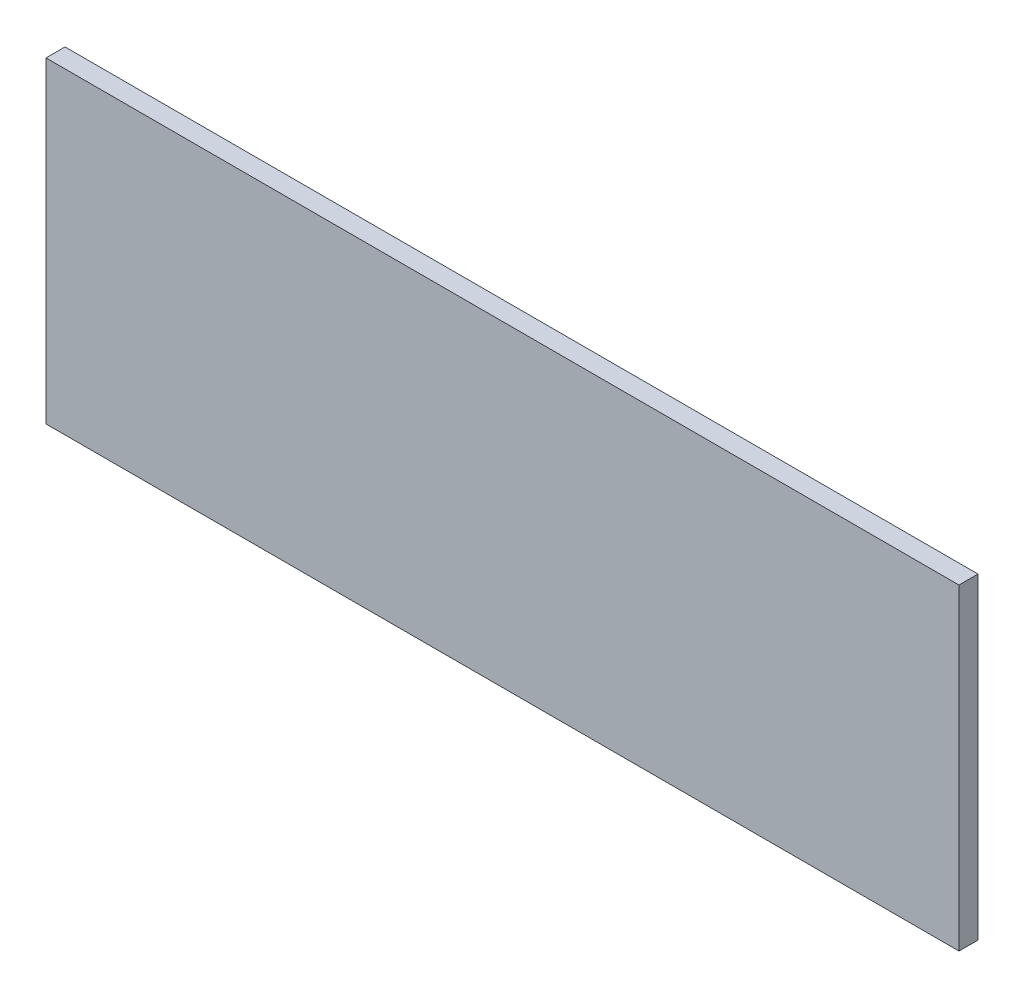
ISO-10303-21;
HEADER;
FILE_DESCRIPTION(('STEP AP214'),'2;1');
FILE_NAME('part.step','',(''),(''),'','','');
FILE_SCHEMA(('AUTOMOTIVE_DESIGN { 1 0 10303 214 1 1 1 1 }'));
ENDSEC;
DATA;
#1=APPLICATION_CONTEXT('core data for automotive mechanical design processes');
#2=APPLICATION_PROTOCOL_DEFINITION('international standard','automotive_design',2000,#1);
#3=PRODUCT_CONTEXT('',#1,'mechanical');
#4=PRODUCT('Part','Part','',(#3));
#5=PRODUCT_RELATED_PRODUCT_CATEGORY('part','',(#4));
#6=PRODUCT_DEFINITION_FORMATION('','',#4);
#7=PRODUCT_DEFINITION_CONTEXT('part definition',#1,'design');
#8=PRODUCT_DEFINITION('design','',#6,#7);
#9=PRODUCT_DEFINITION_SHAPE('','',#8);
#10=(LENGTH_UNIT() NAMED_UNIT(*) SI_UNIT(.MILLI.,.METRE.));
#11=(NAMED_UNIT(*) PLANE_ANGLE_UNIT() SI_UNIT($,.RADIAN.));
#12=(NAMED_UNIT(*) SI_UNIT($,.STERADIAN.) SOLID_ANGLE_UNIT());
#13=UNCERTAINTY_MEASURE_WITH_UNIT(LENGTH_MEASURE(1.E-05),#10,'distance_accuracy_value','');
#14=(GEOMETRIC_REPRESENTATION_CONTEXT(3) GLOBAL_UNCERTAINTY_ASSIGNED_CONTEXT((#13)) GLOBAL_UNIT_ASSIGNED_CONTEXT((#10,
#11,#12)) REPRESENTATION_CONTEXT('',''));
#15=CARTESIAN_POINT('',(0.,0.,0.));
#16=DIRECTION('',(0.,0.,1.));
#17=DIRECTION('',(1.,0.,0.));
#18=AXIS2_PLACEMENT_3D('',#15,#16,#17);
#19=CARTESIAN_POINT('',(-72.0000000000005,25.,3.));
#20=DIRECTION('',(1.,0.,0.));
#21=DIRECTION('',(0.,0.,-1.));
#22=AXIS2_PLACEMENT_3D('',#19,#20,#21);
#23=PLANE('',#22);
#24=DIRECTION('',(0.,-1.,0.));
#25=VECTOR('',#24,1.);
#26=CARTESIAN_POINT('',(-72.0000000000005,25.,0.));
#27=LINE('',#26,#25);
#28=CARTESIAN_POINT('',(-72.0000000000005,25.,0.));
#29=VERTEX_POINT('',#28);
#30=CARTESIAN_POINT('',(-72.0000000000005,-25.,0.));
#31=VERTEX_POINT('',#30);
#32=EDGE_CURVE('E96',#29,#31,#27,.T.);
#33=ORIENTED_EDGE('',*,*,#32,.T.);
#34=DIRECTION('',(0.,0.,-1.));
#35=VECTOR('',#34,1.);
#36=CARTESIAN_POINT('',(-72.0000000000005,-25.,3.));
#37=LINE('',#36,#35);
#38=CARTESIAN_POINT('',(-72.0000000000005,-25.,3.));
#39=VERTEX_POINT('',#38);
#40=EDGE_CURVE('E11',#39,#31,#37,.T.);
#41=ORIENTED_EDGE('',*,*,#40,.F.);
#42=DIRECTION('',(0.,-1.,0.));
#43=VECTOR('',#42,1.);
#44=CARTESIAN_POINT('',(-72.0000000000005,25.,3.));
#45=LINE('',#44,#43);
#46=CARTESIAN_POINT('',(-72.0000000000005,25.,3.));
#47=VERTEX_POINT('',#46);
#48=EDGE_CURVE('E84',#47,#39,#45,.T.);
#49=ORIENTED_EDGE('',*,*,#48,.F.);
#50=DIRECTION('',(0.,0.,-1.));
#51=VECTOR('',#50,1.);
#52=CARTESIAN_POINT('',(-72.0000000000005,25.,3.));
#53=LINE('',#52,#51);
#54=EDGE_CURVE('E92',#47,#29,#53,.T.);
#55=ORIENTED_EDGE('',*,*,#54,.T.);
#56=EDGE_LOOP('',(#33,#41,#49,#55));
#57=FACE_BOUND('',#56,.T.);
#58=ADVANCED_FACE('F33',(#57),#23,.F.);
#59=CARTESIAN_POINT('',(-72.0000000000005,-25.,3.));
#60=DIRECTION('',(0.,1.,0.));
#61=DIRECTION('',(0.,0.,1.));
#62=AXIS2_PLACEMENT_3D('',#59,#60,#61);
#63=PLANE('',#62);
#64=DIRECTION('',(1.,0.,0.));
#65=VECTOR('',#64,1.);
#66=CARTESIAN_POINT('',(-72.0000000000005,-25.,0.));
#67=LINE('',#66,#65);
#68=CARTESIAN_POINT('',(72.0000000000005,-25.,0.));
#69=VERTEX_POINT('',#68);
#70=EDGE_CURVE('E88',#31,#69,#67,.T.);
#71=ORIENTED_EDGE('',*,*,#70,.T.);
#72=DIRECTION('',(0.,0.,-1.));
#73=VECTOR('',#72,1.);
#74=CARTESIAN_POINT('',(72.0000000000005,-25.,3.));
#75=LINE('',#74,#73);
#76=CARTESIAN_POINT('',(72.0000000000005,-25.,3.));
#77=VERTEX_POINT('',#76);
#78=EDGE_CURVE('E41',#77,#69,#75,.T.);
#79=ORIENTED_EDGE('',*,*,#78,.F.);
#80=DIRECTION('',(1.,0.,0.));
#81=VECTOR('',#80,1.);
#82=CARTESIAN_POINT('',(-72.0000000000005,-25.,3.));
#83=LINE('',#82,#81);
#84=EDGE_CURVE('E79',#39,#77,#83,.T.);
#85=ORIENTED_EDGE('',*,*,#84,.F.);
#86=ORIENTED_EDGE('',*,*,#40,.T.);
#87=EDGE_LOOP('',(#71,#79,#85,#86));
#88=FACE_BOUND('',#87,.T.);
#89=ADVANCED_FACE('F87',(#88),#63,.F.);
#90=CARTESIAN_POINT('',(72.0000000000005,25.,3.));
#91=DIRECTION('',(-1.,0.,0.));
#92=DIRECTION('',(0.,0.,1.));
#93=AXIS2_PLACEMENT_3D('',#90,#91,#92);
#94=PLANE('',#93);
#95=DIRECTION('',(0.,1.,0.));
#96=VECTOR('',#95,1.);
#97=CARTESIAN_POINT('',(72.0000000000005,25.,0.));
#98=LINE('',#97,#96);
#99=CARTESIAN_POINT('',(72.0000000000005,25.,0.));
#100=VERTEX_POINT('',#99);
#101=EDGE_CURVE('E66',#69,#100,#98,.T.);
#102=ORIENTED_EDGE('',*,*,#101,.T.);
#103=DIRECTION('',(0.,0.,-1.));
#104=VECTOR('',#103,1.);
#105=CARTESIAN_POINT('',(72.0000000000005,25.,3.));
#106=LINE('',#105,#104);
#107=CARTESIAN_POINT('',(72.0000000000005,25.,3.));
#108=VERTEX_POINT('',#107);
#109=EDGE_CURVE('E89',#108,#100,#106,.T.);
#110=ORIENTED_EDGE('',*,*,#109,.F.);
#111=DIRECTION('',(0.,1.,0.));
#112=VECTOR('',#111,1.);
#113=CARTESIAN_POINT('',(72.0000000000005,25.,3.));
#114=LINE('',#113,#112);
#115=EDGE_CURVE('E82',#77,#108,#114,.T.);
#116=ORIENTED_EDGE('',*,*,#115,.F.);
#117=ORIENTED_EDGE('',*,*,#78,.T.);
#118=EDGE_LOOP('',(#102,#110,#116,#117));
#119=FACE_BOUND('',#118,.T.);
#120=ADVANCED_FACE('F90',(#119),#94,.F.);
#121=CARTESIAN_POINT('',(-72.0000000000005,25.,3.));
#122=DIRECTION('',(0.,-1.,0.));
#123=DIRECTION('',(0.,0.,-1.));
#124=AXIS2_PLACEMENT_3D('',#121,#122,#123);
#125=PLANE('',#124);
#126=DIRECTION('',(-1.,0.,0.));
#127=VECTOR('',#126,1.);
#128=CARTESIAN_POINT('',(-72.0000000000005,25.,0.));
#129=LINE('',#128,#127);
#130=EDGE_CURVE('E72',#100,#29,#129,.T.);
#131=ORIENTED_EDGE('',*,*,#130,.T.);
#132=ORIENTED_EDGE('',*,*,#54,.F.);
#133=DIRECTION('',(-1.,0.,0.));
#134=VECTOR('',#133,1.);
#135=CARTESIAN_POINT('',(-72.0000000000005,25.,3.));
#136=LINE('',#135,#134);
#137=EDGE_CURVE('E49',#108,#47,#136,.T.);
#138=ORIENTED_EDGE('',*,*,#137,.F.);
#139=ORIENTED_EDGE('',*,*,#109,.T.);
#140=EDGE_LOOP('',(#131,#132,#138,#139));
#141=FACE_BOUND('',#140,.T.);
#142=ADVANCED_FACE('F103',(#141),#125,.F.);
#143=CARTESIAN_POINT('',(0.,0.,3.));
#144=DIRECTION('',(0.,0.,1.));
#145=DIRECTION('',(1.,0.,0.));
#146=AXIS2_PLACEMENT_3D('',#143,#144,#145);
#147=PLANE('',#146);
#148=ORIENTED_EDGE('',*,*,#48,.T.);
#149=ORIENTED_EDGE('',*,*,#84,.T.);
#150=ORIENTED_EDGE('',*,*,#115,.T.);
#151=ORIENTED_EDGE('',*,*,#137,.T.);
#152=EDGE_LOOP('',(#148,#149,#150,#151));
#153=FACE_BOUND('',#152,.T.);
#154=ADVANCED_FACE('F80',(#153),#147,.T.);
#155=CARTESIAN_POINT('',(0.,0.,0.));
#156=DIRECTION('',(0.,0.,1.));
#157=DIRECTION('',(1.,0.,0.));
#158=AXIS2_PLACEMENT_3D('',#155,#156,#157);
#159=PLANE('',#158);
#160=ORIENTED_EDGE('',*,*,#32,.F.);
#161=ORIENTED_EDGE('',*,*,#130,.F.);
#162=ORIENTED_EDGE('',*,*,#101,.F.);
#163=ORIENTED_EDGE('',*,*,#70,.F.);
#164=EDGE_LOOP('',(#160,#161,#162,#163));
#165=FACE_BOUND('',#164,.T.);
#166=ADVANCED_FACE('F106',(#165),#159,.F.);
#167=CLOSED_SHELL('',(#58,#89,#120,#142,#154,#166));
#168=MANIFOLD_SOLID_BREP('B2',#167);
#169=ADVANCED_BREP_SHAPE_REPRESENTATION('',(#18,#168),#14);
#170=SHAPE_DEFINITION_REPRESENTATION(#9,#169);
ENDSEC;
END-ISO-10303-21;
